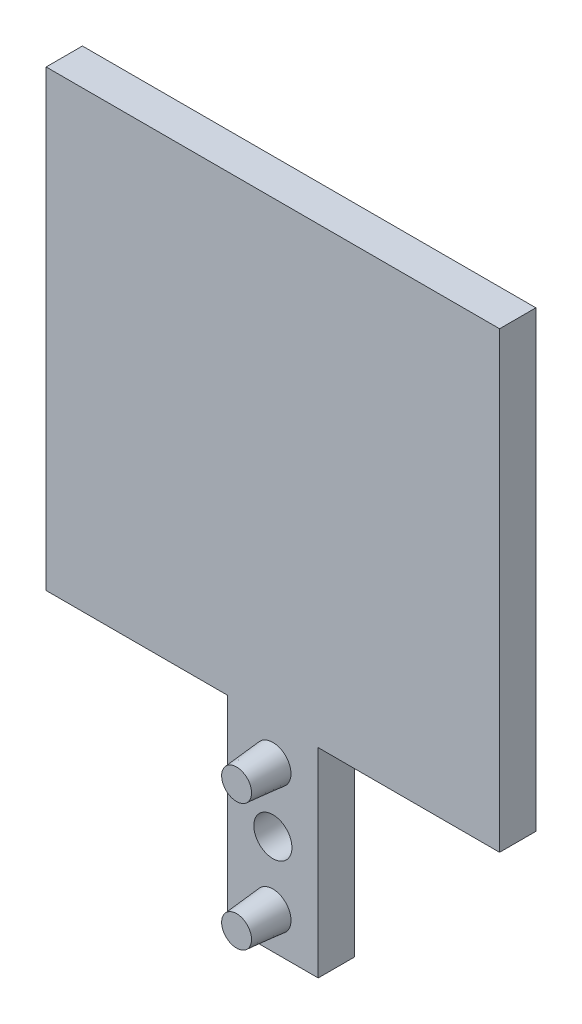
ISO-10303-21;
HEADER;
FILE_DESCRIPTION(('STEP AP214'),'2;1');
FILE_NAME('part.step','',(''),(''),'','','');
FILE_SCHEMA(('AUTOMOTIVE_DESIGN { 1 0 10303 214 1 1 1 1 }'));
ENDSEC;
DATA;
#1=APPLICATION_CONTEXT('core data for automotive mechanical design processes');
#2=APPLICATION_PROTOCOL_DEFINITION('international standard','automotive_design',2000,#1);
#3=PRODUCT_CONTEXT('',#1,'mechanical');
#4=PRODUCT('Part','Part','',(#3));
#5=PRODUCT_RELATED_PRODUCT_CATEGORY('part','',(#4));
#6=PRODUCT_DEFINITION_FORMATION('','',#4);
#7=PRODUCT_DEFINITION_CONTEXT('part definition',#1,'design');
#8=PRODUCT_DEFINITION('design','',#6,#7);
#9=PRODUCT_DEFINITION_SHAPE('','',#8);
#10=(LENGTH_UNIT() NAMED_UNIT(*) SI_UNIT(.MILLI.,.METRE.));
#11=(NAMED_UNIT(*) PLANE_ANGLE_UNIT() SI_UNIT($,.RADIAN.));
#12=(NAMED_UNIT(*) SI_UNIT($,.STERADIAN.) SOLID_ANGLE_UNIT());
#13=UNCERTAINTY_MEASURE_WITH_UNIT(LENGTH_MEASURE(1.E-05),#10,'distance_accuracy_value','');
#14=(GEOMETRIC_REPRESENTATION_CONTEXT(3) GLOBAL_UNCERTAINTY_ASSIGNED_CONTEXT((#13)) GLOBAL_UNIT_ASSIGNED_CONTEXT((#10,
#11,#12)) REPRESENTATION_CONTEXT('',''));
#15=CARTESIAN_POINT('',(0.,0.,0.));
#16=DIRECTION('',(0.,0.,1.));
#17=DIRECTION('',(1.,0.,0.));
#18=AXIS2_PLACEMENT_3D('',#15,#16,#17);
#19=CARTESIAN_POINT('',(0.,0.,4.));
#20=DIRECTION('',(1.,0.,0.));
#21=DIRECTION('',(0.,0.,-1.));
#22=AXIS2_PLACEMENT_3D('',#19,#20,#21);
#23=PLANE('',#22);
#24=DIRECTION('',(0.,-1.,0.));
#25=VECTOR('',#24,1.);
#26=CARTESIAN_POINT('',(0.,0.,0.));
#27=LINE('',#26,#25);
#28=CARTESIAN_POINT('',(0.,50.,0.));
#29=VERTEX_POINT('',#28);
#30=CARTESIAN_POINT('',(0.,0.,0.));
#31=VERTEX_POINT('',#30);
#32=EDGE_CURVE('E130',#29,#31,#27,.T.);
#33=ORIENTED_EDGE('',*,*,#32,.T.);
#34=DIRECTION('',(0.,0.,-1.));
#35=VECTOR('',#34,1.);
#36=CARTESIAN_POINT('',(0.,0.,4.));
#37=LINE('',#36,#35);
#38=CARTESIAN_POINT('',(0.,0.,4.));
#39=VERTEX_POINT('',#38);
#40=EDGE_CURVE('E158',#39,#31,#37,.T.);
#41=ORIENTED_EDGE('',*,*,#40,.F.);
#42=DIRECTION('',(0.,-1.,0.));
#43=VECTOR('',#42,1.);
#44=CARTESIAN_POINT('',(0.,0.,4.));
#45=LINE('',#44,#43);
#46=CARTESIAN_POINT('',(0.,50.,4.));
#47=VERTEX_POINT('',#46);
#48=EDGE_CURVE('E145',#47,#39,#45,.T.);
#49=ORIENTED_EDGE('',*,*,#48,.F.);
#50=DIRECTION('',(0.,0.,-1.));
#51=VECTOR('',#50,1.);
#52=CARTESIAN_POINT('',(0.,50.,4.));
#53=LINE('',#52,#51);
#54=EDGE_CURVE('E126',#47,#29,#53,.T.);
#55=ORIENTED_EDGE('',*,*,#54,.T.);
#56=EDGE_LOOP('',(#33,#41,#49,#55));
#57=FACE_BOUND('',#56,.T.);
#58=ADVANCED_FACE('F33',(#57),#23,.F.);
#59=CARTESIAN_POINT('',(0.,0.,4.));
#60=DIRECTION('',(0.,1.,0.));
#61=DIRECTION('',(0.,0.,1.));
#62=AXIS2_PLACEMENT_3D('',#59,#60,#61);
#63=PLANE('',#62);
#64=DIRECTION('',(1.,0.,0.));
#65=VECTOR('',#64,1.);
#66=CARTESIAN_POINT('',(0.,0.,0.));
#67=LINE('',#66,#65);
#68=CARTESIAN_POINT('',(20.,0.,0.));
#69=VERTEX_POINT('',#68);
#70=EDGE_CURVE('E133',#31,#69,#67,.T.);
#71=ORIENTED_EDGE('',*,*,#70,.T.);
#72=DIRECTION('',(0.,0.,-1.));
#73=VECTOR('',#72,1.);
#74=CARTESIAN_POINT('',(20.,0.,4.));
#75=LINE('',#74,#73);
#76=CARTESIAN_POINT('',(20.,0.,4.));
#77=VERTEX_POINT('',#76);
#78=EDGE_CURVE('E155',#77,#69,#75,.T.);
#79=ORIENTED_EDGE('',*,*,#78,.F.);
#80=DIRECTION('',(1.,0.,0.));
#81=VECTOR('',#80,1.);
#82=CARTESIAN_POINT('',(0.,0.,4.));
#83=LINE('',#82,#81);
#84=EDGE_CURVE('E93',#39,#77,#83,.T.);
#85=ORIENTED_EDGE('',*,*,#84,.F.);
#86=ORIENTED_EDGE('',*,*,#40,.T.);
#87=EDGE_LOOP('',(#71,#79,#85,#86));
#88=FACE_BOUND('',#87,.T.);
#89=ADVANCED_FACE('F180',(#88),#63,.F.);
#90=CARTESIAN_POINT('',(20.,0.,4.));
#91=DIRECTION('',(1.,0.,0.));
#92=DIRECTION('',(0.,1.,0.));
#93=AXIS2_PLACEMENT_3D('',#90,#91,#92);
#94=PLANE('',#93);
#95=DIRECTION('',(0.,-1.,0.));
#96=VECTOR('',#95,1.);
#97=CARTESIAN_POINT('',(20.,0.,0.));
#98=LINE('',#97,#96);
#99=CARTESIAN_POINT('',(20.,-22.,0.));
#100=VERTEX_POINT('',#99);
#101=EDGE_CURVE('E136',#69,#100,#98,.T.);
#102=ORIENTED_EDGE('',*,*,#101,.T.);
#103=DIRECTION('',(0.,0.,-1.));
#104=VECTOR('',#103,1.);
#105=CARTESIAN_POINT('',(20.,-22.,4.));
#106=LINE('',#105,#104);
#107=CARTESIAN_POINT('',(20.,-22.,4.));
#108=VERTEX_POINT('',#107);
#109=EDGE_CURVE('E152',#108,#100,#106,.T.);
#110=ORIENTED_EDGE('',*,*,#109,.F.);
#111=DIRECTION('',(0.,-1.,0.));
#112=VECTOR('',#111,1.);
#113=CARTESIAN_POINT('',(20.,0.,4.));
#114=LINE('',#113,#112);
#115=EDGE_CURVE('E195',#77,#108,#114,.T.);
#116=ORIENTED_EDGE('',*,*,#115,.F.);
#117=ORIENTED_EDGE('',*,*,#78,.T.);
#118=EDGE_LOOP('',(#102,#110,#116,#117));
#119=FACE_BOUND('',#118,.T.);
#120=ADVANCED_FACE('F185',(#119),#94,.F.);
#121=CARTESIAN_POINT('',(20.,-22.,4.));
#122=DIRECTION('',(0.,1.,0.));
#123=DIRECTION('',(0.,0.,1.));
#124=AXIS2_PLACEMENT_3D('',#121,#122,#123);
#125=PLANE('',#124);
#126=DIRECTION('',(1.,0.,0.));
#127=VECTOR('',#126,1.);
#128=CARTESIAN_POINT('',(20.,-22.,0.));
#129=LINE('',#128,#127);
#130=CARTESIAN_POINT('',(30.,-22.,0.));
#131=VERTEX_POINT('',#130);
#132=EDGE_CURVE('E138',#100,#131,#129,.T.);
#133=ORIENTED_EDGE('',*,*,#132,.T.);
#134=DIRECTION('',(0.,0.,-1.));
#135=VECTOR('',#134,1.);
#136=CARTESIAN_POINT('',(30.,-22.,4.));
#137=LINE('',#136,#135);
#138=CARTESIAN_POINT('',(30.,-22.,4.));
#139=VERTEX_POINT('',#138);
#140=EDGE_CURVE('E149',#139,#131,#137,.T.);
#141=ORIENTED_EDGE('',*,*,#140,.F.);
#142=DIRECTION('',(1.,0.,0.));
#143=VECTOR('',#142,1.);
#144=CARTESIAN_POINT('',(20.,-22.,4.));
#145=LINE('',#144,#143);
#146=EDGE_CURVE('E197',#108,#139,#145,.T.);
#147=ORIENTED_EDGE('',*,*,#146,.F.);
#148=ORIENTED_EDGE('',*,*,#109,.T.);
#149=EDGE_LOOP('',(#133,#141,#147,#148));
#150=FACE_BOUND('',#149,.T.);
#151=ADVANCED_FACE('F300',(#150),#125,.F.);
#152=CARTESIAN_POINT('',(30.,0.,4.));
#153=DIRECTION('',(-1.,0.,0.));
#154=DIRECTION('',(0.,-1.,0.));
#155=AXIS2_PLACEMENT_3D('',#152,#153,#154);
#156=PLANE('',#155);
#157=DIRECTION('',(0.,1.,0.));
#158=VECTOR('',#157,1.);
#159=CARTESIAN_POINT('',(30.,0.,0.));
#160=LINE('',#159,#158);
#161=CARTESIAN_POINT('',(30.,0.,0.));
#162=VERTEX_POINT('',#161);
#163=EDGE_CURVE('E140',#131,#162,#160,.T.);
#164=ORIENTED_EDGE('',*,*,#163,.T.);
#165=DIRECTION('',(0.,0.,-1.));
#166=VECTOR('',#165,1.);
#167=CARTESIAN_POINT('',(30.,0.,4.));
#168=LINE('',#167,#166);
#169=CARTESIAN_POINT('',(30.,0.,4.));
#170=VERTEX_POINT('',#169);
#171=EDGE_CURVE('E121',#170,#162,#168,.T.);
#172=ORIENTED_EDGE('',*,*,#171,.F.);
#173=DIRECTION('',(0.,1.,0.));
#174=VECTOR('',#173,1.);
#175=CARTESIAN_POINT('',(30.,0.,4.));
#176=LINE('',#175,#174);
#177=EDGE_CURVE('E112',#139,#170,#176,.T.);
#178=ORIENTED_EDGE('',*,*,#177,.F.);
#179=ORIENTED_EDGE('',*,*,#140,.T.);
#180=EDGE_LOOP('',(#164,#172,#178,#179));
#181=FACE_BOUND('',#180,.T.);
#182=ADVANCED_FACE('F292',(#181),#156,.F.);
#183=CARTESIAN_POINT('',(30.,0.,4.));
#184=DIRECTION('',(0.,1.,0.));
#185=DIRECTION('',(-1.,0.,0.));
#186=AXIS2_PLACEMENT_3D('',#183,#184,#185);
#187=PLANE('',#186);
#188=DIRECTION('',(1.,0.,0.));
#189=VECTOR('',#188,1.);
#190=CARTESIAN_POINT('',(30.,0.,0.));
#191=LINE('',#190,#189);
#192=CARTESIAN_POINT('',(50.,0.,0.));
#193=VERTEX_POINT('',#192);
#194=EDGE_CURVE('E120',#162,#193,#191,.T.);
#195=ORIENTED_EDGE('',*,*,#194,.T.);
#196=DIRECTION('',(0.,0.,-1.));
#197=VECTOR('',#196,1.);
#198=CARTESIAN_POINT('',(50.,0.,4.));
#199=LINE('',#198,#197);
#200=CARTESIAN_POINT('',(50.,0.,4.));
#201=VERTEX_POINT('',#200);
#202=EDGE_CURVE('E117',#201,#193,#199,.T.);
#203=ORIENTED_EDGE('',*,*,#202,.F.);
#204=DIRECTION('',(1.,0.,0.));
#205=VECTOR('',#204,1.);
#206=CARTESIAN_POINT('',(30.,0.,4.));
#207=LINE('',#206,#205);
#208=EDGE_CURVE('E106',#170,#201,#207,.T.);
#209=ORIENTED_EDGE('',*,*,#208,.F.);
#210=ORIENTED_EDGE('',*,*,#171,.T.);
#211=EDGE_LOOP('',(#195,#203,#209,#210));
#212=FACE_BOUND('',#211,.T.);
#213=ADVANCED_FACE('F118',(#212),#187,.F.);
#214=CARTESIAN_POINT('',(50.,0.,4.));
#215=DIRECTION('',(-1.,0.,0.));
#216=DIRECTION('',(0.,0.,1.));
#217=AXIS2_PLACEMENT_3D('',#214,#215,#216);
#218=PLANE('',#217);
#219=DIRECTION('',(0.,1.,0.));
#220=VECTOR('',#219,1.);
#221=CARTESIAN_POINT('',(50.,0.,0.));
#222=LINE('',#221,#220);
#223=CARTESIAN_POINT('',(50.,50.,0.));
#224=VERTEX_POINT('',#223);
#225=EDGE_CURVE('E78',#193,#224,#222,.T.);
#226=ORIENTED_EDGE('',*,*,#225,.T.);
#227=DIRECTION('',(0.,0.,-1.));
#228=VECTOR('',#227,1.);
#229=CARTESIAN_POINT('',(50.,50.,4.));
#230=LINE('',#229,#228);
#231=CARTESIAN_POINT('',(50.,50.,4.));
#232=VERTEX_POINT('',#231);
#233=EDGE_CURVE('E122',#232,#224,#230,.T.);
#234=ORIENTED_EDGE('',*,*,#233,.F.);
#235=DIRECTION('',(0.,1.,0.));
#236=VECTOR('',#235,1.);
#237=CARTESIAN_POINT('',(50.,0.,4.));
#238=LINE('',#237,#236);
#239=EDGE_CURVE('E110',#201,#232,#238,.T.);
#240=ORIENTED_EDGE('',*,*,#239,.F.);
#241=ORIENTED_EDGE('',*,*,#202,.T.);
#242=EDGE_LOOP('',(#226,#234,#240,#241));
#243=FACE_BOUND('',#242,.T.);
#244=ADVANCED_FACE('F124',(#243),#218,.F.);
#245=CARTESIAN_POINT('',(0.,50.,4.));
#246=DIRECTION('',(0.,-1.,0.));
#247=DIRECTION('',(0.,0.,-1.));
#248=AXIS2_PLACEMENT_3D('',#245,#246,#247);
#249=PLANE('',#248);
#250=DIRECTION('',(-1.,0.,0.));
#251=VECTOR('',#250,1.);
#252=CARTESIAN_POINT('',(0.,50.,0.));
#253=LINE('',#252,#251);
#254=EDGE_CURVE('E84',#224,#29,#253,.T.);
#255=ORIENTED_EDGE('',*,*,#254,.T.);
#256=ORIENTED_EDGE('',*,*,#54,.F.);
#257=DIRECTION('',(-1.,0.,0.));
#258=VECTOR('',#257,1.);
#259=CARTESIAN_POINT('',(0.,50.,4.));
#260=LINE('',#259,#258);
#261=EDGE_CURVE('E49',#232,#47,#260,.T.);
#262=ORIENTED_EDGE('',*,*,#261,.F.);
#263=ORIENTED_EDGE('',*,*,#233,.T.);
#264=EDGE_LOOP('',(#255,#256,#262,#263));
#265=FACE_BOUND('',#264,.T.);
#266=ADVANCED_FACE('F166',(#265),#249,.F.);
#267=CARTESIAN_POINT('',(0.,0.,4.));
#268=DIRECTION('',(0.,0.,-1.));
#269=DIRECTION('',(-1.,0.,0.));
#270=AXIS2_PLACEMENT_3D('',#267,#268,#269);
#271=PLANE('',#270);
#272=CARTESIAN_POINT('',(25.,-11.,4.));
#273=DIRECTION('',(0.,0.,1.));
#274=DIRECTION('',(1.,0.,0.));
#275=AXIS2_PLACEMENT_3D('',#272,#273,#274);
#276=CIRCLE('',#275,2.1);
#277=CARTESIAN_POINT('',(27.1,-11.,4.));
#278=VERTEX_POINT('',#277);
#279=EDGE_CURVE('E209',#278,#278,#276,.T.);
#280=ORIENTED_EDGE('',*,*,#279,.F.);
#281=EDGE_LOOP('',(#280));
#282=FACE_BOUND('',#281,.T.);
#283=CARTESIAN_POINT('',(25.,-4.,4.));
#284=DIRECTION('',(0.,0.,-1.));
#285=DIRECTION('',(-1.,0.,0.));
#286=AXIS2_PLACEMENT_3D('',#283,#284,#285);
#287=CIRCLE('',#286,2.);
#288=CARTESIAN_POINT('',(23.,-4.,4.));
#289=VERTEX_POINT('',#288);
#290=EDGE_CURVE('E11',#289,#289,#287,.F.);
#291=ORIENTED_EDGE('',*,*,#290,.F.);
#292=EDGE_LOOP('',(#291));
#293=FACE_BOUND('',#292,.T.);
#294=CARTESIAN_POINT('',(25.,-18.,4.));
#295=DIRECTION('',(0.,0.,-1.));
#296=DIRECTION('',(-1.,0.,0.));
#297=AXIS2_PLACEMENT_3D('',#294,#295,#296);
#298=CIRCLE('',#297,2.);
#299=CARTESIAN_POINT('',(23.,-18.,4.));
#300=VERTEX_POINT('',#299);
#301=EDGE_CURVE('E41',#300,#300,#298,.F.);
#302=ORIENTED_EDGE('',*,*,#301,.F.);
#303=EDGE_LOOP('',(#302));
#304=FACE_BOUND('',#303,.T.);
#305=ORIENTED_EDGE('',*,*,#48,.T.);
#306=ORIENTED_EDGE('',*,*,#84,.T.);
#307=ORIENTED_EDGE('',*,*,#115,.T.);
#308=ORIENTED_EDGE('',*,*,#146,.T.);
#309=ORIENTED_EDGE('',*,*,#177,.T.);
#310=ORIENTED_EDGE('',*,*,#208,.T.);
#311=ORIENTED_EDGE('',*,*,#239,.T.);
#312=ORIENTED_EDGE('',*,*,#261,.T.);
#313=EDGE_LOOP('',(#305,#306,#307,#308,#309,#310,#311,#312));
#314=FACE_BOUND('',#313,.T.);
#315=ADVANCED_FACE('F108',(#282,#293,#304,#314),#271,.F.);
#316=CARTESIAN_POINT('',(0.,0.,0.));
#317=DIRECTION('',(0.,0.,-1.));
#318=DIRECTION('',(-1.,0.,0.));
#319=AXIS2_PLACEMENT_3D('',#316,#317,#318);
#320=PLANE('',#319);
#321=CARTESIAN_POINT('',(25.,-11.,0.));
#322=DIRECTION('',(0.,0.,1.));
#323=DIRECTION('',(1.,0.,0.));
#324=AXIS2_PLACEMENT_3D('',#321,#322,#323);
#325=CIRCLE('',#324,2.1);
#326=CARTESIAN_POINT('',(27.1,-11.,0.));
#327=VERTEX_POINT('',#326);
#328=EDGE_CURVE('E208',#327,#327,#325,.T.);
#329=ORIENTED_EDGE('',*,*,#328,.T.);
#330=EDGE_LOOP('',(#329));
#331=FACE_BOUND('',#330,.T.);
#332=ORIENTED_EDGE('',*,*,#32,.F.);
#333=ORIENTED_EDGE('',*,*,#254,.F.);
#334=ORIENTED_EDGE('',*,*,#225,.F.);
#335=ORIENTED_EDGE('',*,*,#194,.F.);
#336=ORIENTED_EDGE('',*,*,#163,.F.);
#337=ORIENTED_EDGE('',*,*,#132,.F.);
#338=ORIENTED_EDGE('',*,*,#101,.F.);
#339=ORIENTED_EDGE('',*,*,#70,.F.);
#340=EDGE_LOOP('',(#332,#333,#334,#335,#336,#337,#338,#339));
#341=FACE_BOUND('',#340,.T.);
#342=ADVANCED_FACE('F165',(#331,#341),#320,.T.);
#343=CARTESIAN_POINT('',(25.,-18.,4.));
#344=DIRECTION('',(0.,0.,-1.));
#345=DIRECTION('',(1.,0.,0.));
#346=AXIS2_PLACEMENT_3D('',#343,#344,#345);
#347=CONICAL_SURFACE('',#346,2.,0.0872664625997165);
#348=CARTESIAN_POINT('',(25.,-18.,8.));
#349=DIRECTION('',(0.,0.,1.));
#350=DIRECTION('',(1.,0.,0.));
#351=AXIS2_PLACEMENT_3D('',#348,#349,#350);
#352=CIRCLE('',#351,1.65004534589631);
#353=CARTESIAN_POINT('',(26.6500453458963,-18.,8.));
#354=VERTEX_POINT('',#353);
#355=EDGE_CURVE('E134',#354,#354,#352,.T.);
#356=ORIENTED_EDGE('',*,*,#355,.F.);
#357=EDGE_LOOP('',(#356));
#358=FACE_BOUND('',#357,.T.);
#359=ORIENTED_EDGE('',*,*,#301,.T.);
#360=EDGE_LOOP('',(#359));
#361=FACE_BOUND('',#360,.T.);
#362=ADVANCED_FACE('F162',(#358,#361),#347,.T.);
#363=CARTESIAN_POINT('',(25.,-18.,8.));
#364=DIRECTION('',(0.,0.,1.));
#365=DIRECTION('',(1.,0.,0.));
#366=AXIS2_PLACEMENT_3D('',#363,#364,#365);
#367=PLANE('',#366);
#368=ORIENTED_EDGE('',*,*,#355,.T.);
#369=EDGE_LOOP('',(#368));
#370=FACE_BOUND('',#369,.T.);
#371=ADVANCED_FACE('F229',(#370),#367,.T.);
#372=CARTESIAN_POINT('',(25.,-4.,4.));
#373=DIRECTION('',(0.,0.,-1.));
#374=DIRECTION('',(1.,0.,0.));
#375=AXIS2_PLACEMENT_3D('',#372,#373,#374);
#376=CONICAL_SURFACE('',#375,2.,0.0872664625997165);
#377=CARTESIAN_POINT('',(25.,-4.,8.));
#378=DIRECTION('',(0.,0.,1.));
#379=DIRECTION('',(1.,0.,0.));
#380=AXIS2_PLACEMENT_3D('',#377,#378,#379);
#381=CIRCLE('',#380,1.65004534589631);
#382=CARTESIAN_POINT('',(26.6500453458963,-4.,8.));
#383=VERTEX_POINT('',#382);
#384=EDGE_CURVE('E205',#383,#383,#381,.T.);
#385=ORIENTED_EDGE('',*,*,#384,.F.);
#386=EDGE_LOOP('',(#385));
#387=FACE_BOUND('',#386,.T.);
#388=ORIENTED_EDGE('',*,*,#290,.T.);
#389=EDGE_LOOP('',(#388));
#390=FACE_BOUND('',#389,.T.);
#391=ADVANCED_FACE('F223',(#387,#390),#376,.T.);
#392=CARTESIAN_POINT('',(25.,-4.,8.));
#393=DIRECTION('',(0.,0.,1.));
#394=DIRECTION('',(1.,0.,0.));
#395=AXIS2_PLACEMENT_3D('',#392,#393,#394);
#396=PLANE('',#395);
#397=ORIENTED_EDGE('',*,*,#384,.T.);
#398=EDGE_LOOP('',(#397));
#399=FACE_BOUND('',#398,.T.);
#400=ADVANCED_FACE('F218',(#399),#396,.T.);
#401=CARTESIAN_POINT('',(25.,-11.,0.));
#402=DIRECTION('',(0.,0.,1.));
#403=DIRECTION('',(1.,0.,0.));
#404=AXIS2_PLACEMENT_3D('',#401,#402,#403);
#405=CYLINDRICAL_SURFACE('',#404,2.1);
#406=ORIENTED_EDGE('',*,*,#328,.F.);
#407=EDGE_LOOP('',(#406));
#408=FACE_BOUND('',#407,.T.);
#409=ORIENTED_EDGE('',*,*,#279,.T.);
#410=EDGE_LOOP('',(#409));
#411=FACE_BOUND('',#410,.T.);
#412=ADVANCED_FACE('F215',(#408,#411),#405,.F.);
#413=CLOSED_SHELL('',(#58,#89,#120,#151,#182,#213,#244,#266,#315,#342,#362,#371,#391,#400,#412));
#414=MANIFOLD_SOLID_BREP('B2',#413);
#415=ADVANCED_BREP_SHAPE_REPRESENTATION('',(#18,#414),#14);
#416=SHAPE_DEFINITION_REPRESENTATION(#9,#415);
ENDSEC;
END-ISO-10303-21;
